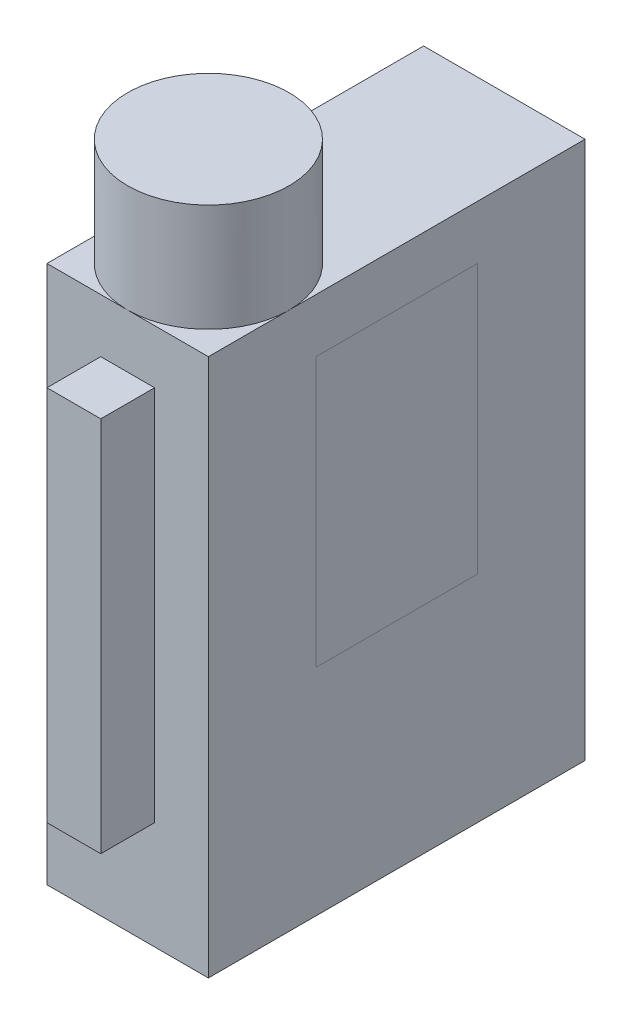
ISO-10303-21;
HEADER;
FILE_DESCRIPTION(('STEP AP214'),'2;1');
FILE_NAME('part.step','',(''),(''),'','','');
FILE_SCHEMA(('AUTOMOTIVE_DESIGN { 1 0 10303 214 1 1 1 1 }'));
ENDSEC;
DATA;
#1=APPLICATION_CONTEXT('core data for automotive mechanical design processes');
#2=APPLICATION_PROTOCOL_DEFINITION('international standard','automotive_design',2000,#1);
#3=PRODUCT_CONTEXT('',#1,'mechanical');
#4=PRODUCT('Part','Part','',(#3));
#5=PRODUCT_RELATED_PRODUCT_CATEGORY('part','',(#4));
#6=PRODUCT_DEFINITION_FORMATION('','',#4);
#7=PRODUCT_DEFINITION_CONTEXT('part definition',#1,'design');
#8=PRODUCT_DEFINITION('design','',#6,#7);
#9=PRODUCT_DEFINITION_SHAPE('','',#8);
#10=(LENGTH_UNIT() NAMED_UNIT(*) SI_UNIT(.MILLI.,.METRE.));
#11=(NAMED_UNIT(*) PLANE_ANGLE_UNIT() SI_UNIT($,.RADIAN.));
#12=(NAMED_UNIT(*) SI_UNIT($,.STERADIAN.) SOLID_ANGLE_UNIT());
#13=UNCERTAINTY_MEASURE_WITH_UNIT(LENGTH_MEASURE(1.E-05),#10,'distance_accuracy_value','');
#14=(GEOMETRIC_REPRESENTATION_CONTEXT(3) GLOBAL_UNCERTAINTY_ASSIGNED_CONTEXT((#13)) GLOBAL_UNIT_ASSIGNED_CONTEXT((#10,
#11,#12)) REPRESENTATION_CONTEXT('',''));
#15=CARTESIAN_POINT('',(0.,0.,0.));
#16=DIRECTION('',(0.,0.,1.));
#17=DIRECTION('',(1.,0.,0.));
#18=AXIS2_PLACEMENT_3D('',#15,#16,#17);
#19=CARTESIAN_POINT('',(30.,0.,70.));
#20=DIRECTION('',(-1.,0.,0.));
#21=DIRECTION('',(0.,0.,1.));
#22=AXIS2_PLACEMENT_3D('',#19,#20,#21);
#23=PLANE('',#22);
#24=DIRECTION('',(0.,1.,0.));
#25=VECTOR('',#24,1.);
#26=CARTESIAN_POINT('',(30.,0.,0.));
#27=LINE('',#26,#25);
#28=CARTESIAN_POINT('',(30.,0.,0.));
#29=VERTEX_POINT('',#28);
#30=CARTESIAN_POINT('',(30.,100.,0.));
#31=VERTEX_POINT('',#30);
#32=EDGE_CURVE('E201',#29,#31,#27,.T.);
#33=ORIENTED_EDGE('',*,*,#32,.T.);
#34=DIRECTION('',(0.,0.,-1.));
#35=VECTOR('',#34,1.);
#36=CARTESIAN_POINT('',(30.,100.,70.));
#37=LINE('',#36,#35);
#38=CARTESIAN_POINT('',(30.,100.,55.));
#39=VERTEX_POINT('',#38);
#40=EDGE_CURVE('E207',#39,#31,#37,.T.);
#41=ORIENTED_EDGE('',*,*,#40,.F.);
#42=CARTESIAN_POINT('',(30.,100.,70.));
#43=VERTEX_POINT('',#42);
#44=EDGE_CURVE('E143',#43,#39,#37,.T.);
#45=ORIENTED_EDGE('',*,*,#44,.F.);
#46=DIRECTION('',(0.,1.,0.));
#47=VECTOR('',#46,1.);
#48=CARTESIAN_POINT('',(30.,0.,70.));
#49=LINE('',#48,#47);
#50=CARTESIAN_POINT('',(30.,0.,70.));
#51=VERTEX_POINT('',#50);
#52=EDGE_CURVE('E125',#51,#43,#49,.T.);
#53=ORIENTED_EDGE('',*,*,#52,.F.);
#54=DIRECTION('',(0.,0.,-1.));
#55=VECTOR('',#54,1.);
#56=CARTESIAN_POINT('',(30.,0.,70.));
#57=LINE('',#56,#55);
#58=EDGE_CURVE('E153',#51,#29,#57,.T.);
#59=ORIENTED_EDGE('',*,*,#58,.T.);
#60=EDGE_LOOP('',(#33,#41,#45,#53,#59));
#61=FACE_BOUND('',#60,.T.);
#62=DIRECTION('',(0.,-1.,0.));
#63=VECTOR('',#62,1.);
#64=CARTESIAN_POINT('',(30.,0.,50.));
#65=LINE('',#64,#63);
#66=CARTESIAN_POINT('',(30.,90.,50.));
#67=VERTEX_POINT('',#66);
#68=CARTESIAN_POINT('',(30.,40.,50.));
#69=VERTEX_POINT('',#68);
#70=EDGE_CURVE('E11',#67,#69,#65,.T.);
#71=ORIENTED_EDGE('',*,*,#70,.F.);
#72=DIRECTION('',(0.,0.,1.));
#73=VECTOR('',#72,1.);
#74=CARTESIAN_POINT('',(30.,90.,70.));
#75=LINE('',#74,#73);
#76=CARTESIAN_POINT('',(30.,90.,20.));
#77=VERTEX_POINT('',#76);
#78=EDGE_CURVE('E151',#77,#67,#75,.T.);
#79=ORIENTED_EDGE('',*,*,#78,.F.);
#80=DIRECTION('',(0.,1.,0.));
#81=VECTOR('',#80,1.);
#82=CARTESIAN_POINT('',(30.,0.,20.));
#83=LINE('',#82,#81);
#84=CARTESIAN_POINT('',(30.,40.,20.));
#85=VERTEX_POINT('',#84);
#86=EDGE_CURVE('E213',#85,#77,#83,.T.);
#87=ORIENTED_EDGE('',*,*,#86,.F.);
#88=DIRECTION('',(0.,0.,-1.));
#89=VECTOR('',#88,1.);
#90=CARTESIAN_POINT('',(30.,40.,70.));
#91=LINE('',#90,#89);
#92=EDGE_CURVE('E45',#69,#85,#91,.T.);
#93=ORIENTED_EDGE('',*,*,#92,.F.);
#94=EDGE_LOOP('',(#71,#79,#87,#93));
#95=FACE_BOUND('',#94,.T.);
#96=ADVANCED_FACE('F36',(#61,#95),#23,.F.);
#97=CARTESIAN_POINT('',(0.,100.,70.));
#98=DIRECTION('',(0.,-1.,0.));
#99=DIRECTION('',(0.,0.,-1.));
#100=AXIS2_PLACEMENT_3D('',#97,#98,#99);
#101=PLANE('',#100);
#102=CARTESIAN_POINT('',(15.,100.,55.));
#103=DIRECTION('',(0.,1.,0.));
#104=DIRECTION('',(0.,0.,1.));
#105=AXIS2_PLACEMENT_3D('',#102,#103,#104);
#106=CIRCLE('',#105,15.);
#107=CARTESIAN_POINT('',(15.,100.,70.));
#108=VERTEX_POINT('',#107);
#109=EDGE_CURVE('E141',#108,#39,#106,.T.);
#110=ORIENTED_EDGE('',*,*,#109,.F.);
#111=DIRECTION('',(-1.,0.,0.));
#112=VECTOR('',#111,1.);
#113=CARTESIAN_POINT('',(0.,100.,70.));
#114=LINE('',#113,#112);
#115=EDGE_CURVE('E117',#43,#108,#114,.T.);
#116=ORIENTED_EDGE('',*,*,#115,.F.);
#117=ORIENTED_EDGE('',*,*,#44,.T.);
#118=EDGE_LOOP('',(#110,#116,#117));
#119=FACE_BOUND('',#118,.T.);
#120=ADVANCED_FACE('F142',(#119),#101,.F.);
#121=CARTESIAN_POINT('',(0.,100.,55.));
#122=VERTEX_POINT('',#121);
#123=EDGE_CURVE('E148',#39,#122,#106,.T.);
#124=ORIENTED_EDGE('',*,*,#123,.F.);
#125=ORIENTED_EDGE('',*,*,#40,.T.);
#126=DIRECTION('',(-1.,0.,0.));
#127=VECTOR('',#126,1.);
#128=CARTESIAN_POINT('',(0.,100.,0.));
#129=LINE('',#128,#127);
#130=CARTESIAN_POINT('',(0.,100.,0.));
#131=VERTEX_POINT('',#130);
#132=EDGE_CURVE('E194',#31,#131,#129,.T.);
#133=ORIENTED_EDGE('',*,*,#132,.T.);
#134=DIRECTION('',(0.,0.,-1.));
#135=VECTOR('',#134,1.);
#136=CARTESIAN_POINT('',(0.,100.,70.));
#137=LINE('',#136,#135);
#138=EDGE_CURVE('E130',#122,#131,#137,.T.);
#139=ORIENTED_EDGE('',*,*,#138,.F.);
#140=EDGE_LOOP('',(#124,#125,#133,#139));
#141=FACE_BOUND('',#140,.T.);
#142=ADVANCED_FACE('F235',(#141),#101,.F.);
#143=EDGE_CURVE('E135',#122,#108,#106,.T.);
#144=ORIENTED_EDGE('',*,*,#143,.F.);
#145=CARTESIAN_POINT('',(0.,100.,70.));
#146=VERTEX_POINT('',#145);
#147=EDGE_CURVE('E138',#146,#122,#137,.T.);
#148=ORIENTED_EDGE('',*,*,#147,.F.);
#149=EDGE_CURVE('E122',#108,#146,#114,.T.);
#150=ORIENTED_EDGE('',*,*,#149,.F.);
#151=EDGE_LOOP('',(#144,#148,#150));
#152=FACE_BOUND('',#151,.T.);
#153=ADVANCED_FACE('F133',(#152),#101,.F.);
#154=CARTESIAN_POINT('',(0.,0.,70.));
#155=DIRECTION('',(0.,0.,-1.));
#156=DIRECTION('',(-1.,0.,0.));
#157=AXIS2_PLACEMENT_3D('',#154,#155,#156);
#158=PLANE('',#157);
#159=DIRECTION('',(0.,-1.,0.));
#160=VECTOR('',#159,1.);
#161=CARTESIAN_POINT('',(0.,0.,70.));
#162=LINE('',#161,#160);
#163=CARTESIAN_POINT('',(0.,0.,70.));
#164=VERTEX_POINT('',#163);
#165=EDGE_CURVE('E191',#146,#164,#162,.T.);
#166=ORIENTED_EDGE('',*,*,#165,.T.);
#167=DIRECTION('',(1.,0.,0.));
#168=VECTOR('',#167,1.);
#169=CARTESIAN_POINT('',(0.,0.,70.));
#170=LINE('',#169,#168);
#171=EDGE_CURVE('E193',#164,#51,#170,.T.);
#172=ORIENTED_EDGE('',*,*,#171,.T.);
#173=ORIENTED_EDGE('',*,*,#52,.T.);
#174=ORIENTED_EDGE('',*,*,#115,.T.);
#175=ORIENTED_EDGE('',*,*,#149,.T.);
#176=EDGE_LOOP('',(#166,#172,#173,#174,#175));
#177=FACE_BOUND('',#176,.T.);
#178=DIRECTION('',(0.,-1.,0.));
#179=VECTOR('',#178,1.);
#180=CARTESIAN_POINT('',(10.,90.,70.));
#181=LINE('',#180,#179);
#182=CARTESIAN_POINT('',(10.,90.,70.));
#183=VERTEX_POINT('',#182);
#184=CARTESIAN_POINT('',(10.,20.,70.));
#185=VERTEX_POINT('',#184);
#186=EDGE_CURVE('E168',#183,#185,#181,.T.);
#187=ORIENTED_EDGE('',*,*,#186,.F.);
#188=DIRECTION('',(-1.,0.,0.));
#189=VECTOR('',#188,1.);
#190=CARTESIAN_POINT('',(10.,90.,70.));
#191=LINE('',#190,#189);
#192=CARTESIAN_POINT('',(20.,90.,70.));
#193=VERTEX_POINT('',#192);
#194=EDGE_CURVE('E161',#193,#183,#191,.T.);
#195=ORIENTED_EDGE('',*,*,#194,.F.);
#196=DIRECTION('',(0.,1.,0.));
#197=VECTOR('',#196,1.);
#198=CARTESIAN_POINT('',(20.,90.,70.));
#199=LINE('',#198,#197);
#200=CARTESIAN_POINT('',(20.,20.,70.));
#201=VERTEX_POINT('',#200);
#202=EDGE_CURVE('E174',#201,#193,#199,.T.);
#203=ORIENTED_EDGE('',*,*,#202,.F.);
#204=DIRECTION('',(1.,0.,0.));
#205=VECTOR('',#204,1.);
#206=CARTESIAN_POINT('',(10.,20.,70.));
#207=LINE('',#206,#205);
#208=EDGE_CURVE('E171',#185,#201,#207,.T.);
#209=ORIENTED_EDGE('',*,*,#208,.F.);
#210=EDGE_LOOP('',(#187,#195,#203,#209));
#211=FACE_BOUND('',#210,.T.);
#212=ADVANCED_FACE('F120',(#177,#211),#158,.F.);
#213=CARTESIAN_POINT('',(0.,0.,70.));
#214=DIRECTION('',(1.,0.,0.));
#215=DIRECTION('',(0.,0.,-1.));
#216=AXIS2_PLACEMENT_3D('',#213,#214,#215);
#217=PLANE('',#216);
#218=DIRECTION('',(0.,-1.,0.));
#219=VECTOR('',#218,1.);
#220=CARTESIAN_POINT('',(0.,0.,0.));
#221=LINE('',#220,#219);
#222=CARTESIAN_POINT('',(0.,0.,0.));
#223=VERTEX_POINT('',#222);
#224=EDGE_CURVE('E190',#131,#223,#221,.T.);
#225=ORIENTED_EDGE('',*,*,#224,.T.);
#226=DIRECTION('',(0.,0.,-1.));
#227=VECTOR('',#226,1.);
#228=CARTESIAN_POINT('',(0.,0.,70.));
#229=LINE('',#228,#227);
#230=EDGE_CURVE('E150',#164,#223,#229,.T.);
#231=ORIENTED_EDGE('',*,*,#230,.F.);
#232=ORIENTED_EDGE('',*,*,#165,.F.);
#233=ORIENTED_EDGE('',*,*,#147,.T.);
#234=ORIENTED_EDGE('',*,*,#138,.T.);
#235=EDGE_LOOP('',(#225,#231,#232,#233,#234));
#236=FACE_BOUND('',#235,.T.);
#237=ADVANCED_FACE('F38',(#236),#217,.F.);
#238=CARTESIAN_POINT('',(0.,0.,70.));
#239=DIRECTION('',(0.,1.,0.));
#240=DIRECTION('',(0.,0.,1.));
#241=AXIS2_PLACEMENT_3D('',#238,#239,#240);
#242=PLANE('',#241);
#243=DIRECTION('',(1.,0.,0.));
#244=VECTOR('',#243,1.);
#245=CARTESIAN_POINT('',(0.,0.,0.));
#246=LINE('',#245,#244);
#247=EDGE_CURVE('E199',#223,#29,#246,.T.);
#248=ORIENTED_EDGE('',*,*,#247,.T.);
#249=ORIENTED_EDGE('',*,*,#58,.F.);
#250=ORIENTED_EDGE('',*,*,#171,.F.);
#251=ORIENTED_EDGE('',*,*,#230,.T.);
#252=EDGE_LOOP('',(#248,#249,#250,#251));
#253=FACE_BOUND('',#252,.T.);
#254=ADVANCED_FACE('F239',(#253),#242,.F.);
#255=ORIENTED_EDGE('',*,*,#78,.T.);
#256=ORIENTED_EDGE('',*,*,#70,.T.);
#257=ORIENTED_EDGE('',*,*,#92,.T.);
#258=ORIENTED_EDGE('',*,*,#86,.T.);
#259=EDGE_LOOP('',(#255,#256,#257,#258));
#260=FACE_BOUND('',#259,.T.);
#261=ADVANCED_FACE('F225',(#260),#23,.F.);
#262=CARTESIAN_POINT('',(0.,0.,0.));
#263=DIRECTION('',(0.,0.,-1.));
#264=DIRECTION('',(-1.,0.,0.));
#265=AXIS2_PLACEMENT_3D('',#262,#263,#264);
#266=PLANE('',#265);
#267=ORIENTED_EDGE('',*,*,#224,.F.);
#268=ORIENTED_EDGE('',*,*,#132,.F.);
#269=ORIENTED_EDGE('',*,*,#32,.F.);
#270=ORIENTED_EDGE('',*,*,#247,.F.);
#271=EDGE_LOOP('',(#267,#268,#269,#270));
#272=FACE_BOUND('',#271,.T.);
#273=ADVANCED_FACE('F238',(#272),#266,.T.);
#274=CARTESIAN_POINT('',(10.,90.,80.));
#275=DIRECTION('',(1.,0.,0.));
#276=DIRECTION('',(0.,1.,0.));
#277=AXIS2_PLACEMENT_3D('',#274,#275,#276);
#278=PLANE('',#277);
#279=ORIENTED_EDGE('',*,*,#186,.T.);
#280=DIRECTION('',(0.,0.,-1.));
#281=VECTOR('',#280,1.);
#282=CARTESIAN_POINT('',(10.,20.,80.));
#283=LINE('',#282,#281);
#284=CARTESIAN_POINT('',(10.,20.,80.));
#285=VERTEX_POINT('',#284);
#286=EDGE_CURVE('E187',#285,#185,#283,.T.);
#287=ORIENTED_EDGE('',*,*,#286,.F.);
#288=DIRECTION('',(0.,-1.,0.));
#289=VECTOR('',#288,1.);
#290=CARTESIAN_POINT('',(10.,90.,80.));
#291=LINE('',#290,#289);
#292=CARTESIAN_POINT('',(10.,90.,80.));
#293=VERTEX_POINT('',#292);
#294=EDGE_CURVE('E157',#293,#285,#291,.T.);
#295=ORIENTED_EDGE('',*,*,#294,.F.);
#296=DIRECTION('',(0.,0.,-1.));
#297=VECTOR('',#296,1.);
#298=CARTESIAN_POINT('',(10.,90.,80.));
#299=LINE('',#298,#297);
#300=EDGE_CURVE('E167',#293,#183,#299,.T.);
#301=ORIENTED_EDGE('',*,*,#300,.T.);
#302=EDGE_LOOP('',(#279,#287,#295,#301));
#303=FACE_BOUND('',#302,.T.);
#304=ADVANCED_FACE('F242',(#303),#278,.F.);
#305=CARTESIAN_POINT('',(10.,20.,80.));
#306=DIRECTION('',(0.,1.,0.));
#307=DIRECTION('',(0.,0.,1.));
#308=AXIS2_PLACEMENT_3D('',#305,#306,#307);
#309=PLANE('',#308);
#310=ORIENTED_EDGE('',*,*,#208,.T.);
#311=DIRECTION('',(0.,0.,-1.));
#312=VECTOR('',#311,1.);
#313=CARTESIAN_POINT('',(20.,20.,80.));
#314=LINE('',#313,#312);
#315=CARTESIAN_POINT('',(20.,20.,80.));
#316=VERTEX_POINT('',#315);
#317=EDGE_CURVE('E184',#316,#201,#314,.T.);
#318=ORIENTED_EDGE('',*,*,#317,.F.);
#319=DIRECTION('',(1.,0.,0.));
#320=VECTOR('',#319,1.);
#321=CARTESIAN_POINT('',(10.,20.,80.));
#322=LINE('',#321,#320);
#323=EDGE_CURVE('E160',#285,#316,#322,.T.);
#324=ORIENTED_EDGE('',*,*,#323,.F.);
#325=ORIENTED_EDGE('',*,*,#286,.T.);
#326=EDGE_LOOP('',(#310,#318,#324,#325));
#327=FACE_BOUND('',#326,.T.);
#328=ADVANCED_FACE('F268',(#327),#309,.F.);
#329=CARTESIAN_POINT('',(20.,90.,80.));
#330=DIRECTION('',(-1.,0.,0.));
#331=DIRECTION('',(0.,-1.,0.));
#332=AXIS2_PLACEMENT_3D('',#329,#330,#331);
#333=PLANE('',#332);
#334=ORIENTED_EDGE('',*,*,#202,.T.);
#335=DIRECTION('',(0.,0.,-1.));
#336=VECTOR('',#335,1.);
#337=CARTESIAN_POINT('',(20.,90.,80.));
#338=LINE('',#337,#336);
#339=CARTESIAN_POINT('',(20.,90.,80.));
#340=VERTEX_POINT('',#339);
#341=EDGE_CURVE('E181',#340,#193,#338,.T.);
#342=ORIENTED_EDGE('',*,*,#341,.F.);
#343=DIRECTION('',(0.,1.,0.));
#344=VECTOR('',#343,1.);
#345=CARTESIAN_POINT('',(20.,90.,80.));
#346=LINE('',#345,#344);
#347=EDGE_CURVE('E163',#316,#340,#346,.T.);
#348=ORIENTED_EDGE('',*,*,#347,.F.);
#349=ORIENTED_EDGE('',*,*,#317,.T.);
#350=EDGE_LOOP('',(#334,#342,#348,#349));
#351=FACE_BOUND('',#350,.T.);
#352=ADVANCED_FACE('F272',(#351),#333,.F.);
#353=CARTESIAN_POINT('',(10.,90.,80.));
#354=DIRECTION('',(0.,-1.,0.));
#355=DIRECTION('',(0.,0.,-1.));
#356=AXIS2_PLACEMENT_3D('',#353,#354,#355);
#357=PLANE('',#356);
#358=ORIENTED_EDGE('',*,*,#194,.T.);
#359=ORIENTED_EDGE('',*,*,#300,.F.);
#360=DIRECTION('',(-1.,0.,0.));
#361=VECTOR('',#360,1.);
#362=CARTESIAN_POINT('',(10.,90.,80.));
#363=LINE('',#362,#361);
#364=EDGE_CURVE('E165',#340,#293,#363,.T.);
#365=ORIENTED_EDGE('',*,*,#364,.F.);
#366=ORIENTED_EDGE('',*,*,#341,.T.);
#367=EDGE_LOOP('',(#358,#359,#365,#366));
#368=FACE_BOUND('',#367,.T.);
#369=ADVANCED_FACE('F276',(#368),#357,.F.);
#370=CARTESIAN_POINT('',(0.,0.,80.));
#371=DIRECTION('',(0.,0.,1.));
#372=DIRECTION('',(1.,0.,0.));
#373=AXIS2_PLACEMENT_3D('',#370,#371,#372);
#374=PLANE('',#373);
#375=ORIENTED_EDGE('',*,*,#294,.T.);
#376=ORIENTED_EDGE('',*,*,#323,.T.);
#377=ORIENTED_EDGE('',*,*,#347,.T.);
#378=ORIENTED_EDGE('',*,*,#364,.T.);
#379=EDGE_LOOP('',(#375,#376,#377,#378));
#380=FACE_BOUND('',#379,.T.);
#381=ADVANCED_FACE('F280',(#380),#374,.T.);
#382=CARTESIAN_POINT('',(15.,120.,55.));
#383=DIRECTION('',(0.,-1.,0.));
#384=DIRECTION('',(0.,0.,-1.));
#385=AXIS2_PLACEMENT_3D('',#382,#383,#384);
#386=CYLINDRICAL_SURFACE('',#385,15.);
#387=CARTESIAN_POINT('',(15.,120.,55.));
#388=DIRECTION('',(0.,1.,0.));
#389=DIRECTION('',(0.,0.,1.));
#390=AXIS2_PLACEMENT_3D('',#387,#388,#389);
#391=CIRCLE('',#390,15.);
#392=CARTESIAN_POINT('',(15.,120.,70.));
#393=VERTEX_POINT('',#392);
#394=EDGE_CURVE('E146',#393,#393,#391,.T.);
#395=ORIENTED_EDGE('',*,*,#394,.F.);
#396=EDGE_LOOP('',(#395));
#397=FACE_BOUND('',#396,.T.);
#398=ORIENTED_EDGE('',*,*,#109,.T.);
#399=ORIENTED_EDGE('',*,*,#123,.T.);
#400=ORIENTED_EDGE('',*,*,#143,.T.);
#401=EDGE_LOOP('',(#398,#399,#400));
#402=FACE_BOUND('',#401,.T.);
#403=ADVANCED_FACE('F149',(#397,#402),#386,.T.);
#404=CARTESIAN_POINT('',(15.,120.,55.));
#405=DIRECTION('',(0.,1.,0.));
#406=DIRECTION('',(0.,0.,1.));
#407=AXIS2_PLACEMENT_3D('',#404,#405,#406);
#408=PLANE('',#407);
#409=ORIENTED_EDGE('',*,*,#394,.T.);
#410=EDGE_LOOP('',(#409));
#411=FACE_BOUND('',#410,.T.);
#412=ADVANCED_FACE('F287',(#411),#408,.T.);
#413=CLOSED_SHELL('',(#96,#120,#142,#153,#212,#237,#254,#261,#273,#304,#328,#352,#369,#381,#403,#412));
#414=MANIFOLD_SOLID_BREP('B2',#413);
#415=ADVANCED_BREP_SHAPE_REPRESENTATION('',(#18,#414),#14);
#416=SHAPE_DEFINITION_REPRESENTATION(#9,#415);
ENDSEC;
END-ISO-10303-21;
